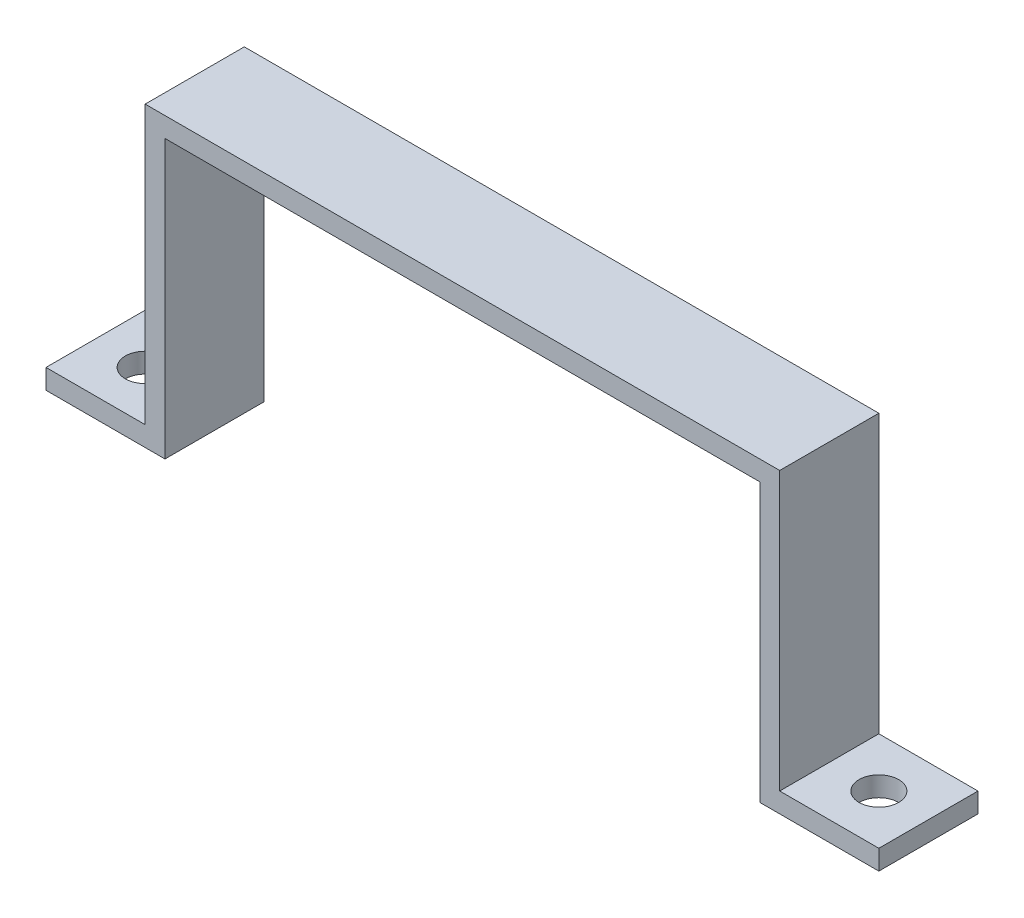
ISO-10303-21;
HEADER;
FILE_DESCRIPTION(('STEP AP214'),'2;1');
FILE_NAME('part.step','',(''),(''),'','','');
FILE_SCHEMA(('AUTOMOTIVE_DESIGN { 1 0 10303 214 1 1 1 1 }'));
ENDSEC;
DATA;
#1=APPLICATION_CONTEXT('core data for automotive mechanical design processes');
#2=APPLICATION_PROTOCOL_DEFINITION('international standard','automotive_design',2000,#1);
#3=PRODUCT_CONTEXT('',#1,'mechanical');
#4=PRODUCT('Part','Part','',(#3));
#5=PRODUCT_RELATED_PRODUCT_CATEGORY('part','',(#4));
#6=PRODUCT_DEFINITION_FORMATION('','',#4);
#7=PRODUCT_DEFINITION_CONTEXT('part definition',#1,'design');
#8=PRODUCT_DEFINITION('design','',#6,#7);
#9=PRODUCT_DEFINITION_SHAPE('','',#8);
#10=(LENGTH_UNIT() NAMED_UNIT(*) SI_UNIT(.MILLI.,.METRE.));
#11=(NAMED_UNIT(*) PLANE_ANGLE_UNIT() SI_UNIT($,.RADIAN.));
#12=(NAMED_UNIT(*) SI_UNIT($,.STERADIAN.) SOLID_ANGLE_UNIT());
#13=UNCERTAINTY_MEASURE_WITH_UNIT(LENGTH_MEASURE(1.E-05),#10,'distance_accuracy_value','');
#14=(GEOMETRIC_REPRESENTATION_CONTEXT(3) GLOBAL_UNCERTAINTY_ASSIGNED_CONTEXT((#13)) GLOBAL_UNIT_ASSIGNED_CONTEXT((#10,
#11,#12)) REPRESENTATION_CONTEXT('',''));
#15=CARTESIAN_POINT('',(0.,0.,0.));
#16=DIRECTION('',(0.,0.,1.));
#17=DIRECTION('',(1.,0.,0.));
#18=AXIS2_PLACEMENT_3D('',#15,#16,#17);
#19=CARTESIAN_POINT('',(-37.4285121000212,-21.3533376917352,10.));
#20=DIRECTION('',(0.,1.,0.));
#21=DIRECTION('',(0.,0.,1.));
#22=AXIS2_PLACEMENT_3D('',#19,#20,#21);
#23=PLANE('',#22);
#24=CARTESIAN_POINT('',(-42.4285121000212,-21.3533376917352,5.));
#25=DIRECTION('',(0.,1.,0.));
#26=DIRECTION('',(0.,0.,1.));
#27=AXIS2_PLACEMENT_3D('',#24,#25,#26);
#28=CIRCLE('',#27,2.);
#29=CARTESIAN_POINT('',(-42.4285121000212,-21.3533376917352,7.));
#30=VERTEX_POINT('',#29);
#31=EDGE_CURVE('E193',#30,#30,#28,.T.);
#32=ORIENTED_EDGE('',*,*,#31,.T.);
#33=EDGE_LOOP('',(#32));
#34=FACE_BOUND('',#33,.T.);
#35=DIRECTION('',(1.,0.,0.));
#36=VECTOR('',#35,1.);
#37=CARTESIAN_POINT('',(-57.4285121000211,-21.3533376917352,10.));
#38=LINE('',#37,#36);
#39=CARTESIAN_POINT('',(-47.4285121000212,-21.3533376917352,10.));
#40=VERTEX_POINT('',#39);
#41=CARTESIAN_POINT('',(-35.4285121000211,-21.3533376917352,10.));
#42=VERTEX_POINT('',#41);
#43=EDGE_CURVE('E153',#40,#42,#38,.T.);
#44=ORIENTED_EDGE('',*,*,#43,.F.);
#45=DIRECTION('',(0.,0.,-1.));
#46=VECTOR('',#45,1.);
#47=CARTESIAN_POINT('',(-47.4285121000212,-21.3533376917352,10.));
#48=LINE('',#47,#46);
#49=CARTESIAN_POINT('',(-47.4285121000212,-21.3533376917352,0.));
#50=VERTEX_POINT('',#49);
#51=EDGE_CURVE('E179',#40,#50,#48,.T.);
#52=ORIENTED_EDGE('',*,*,#51,.T.);
#53=DIRECTION('',(1.,0.,0.));
#54=VECTOR('',#53,1.);
#55=CARTESIAN_POINT('',(-37.4285121000212,-21.3533376917352,0.));
#56=LINE('',#55,#54);
#57=CARTESIAN_POINT('',(-35.4285121000211,-21.3533376917352,0.));
#58=VERTEX_POINT('',#57);
#59=EDGE_CURVE('E186',#50,#58,#56,.T.);
#60=ORIENTED_EDGE('',*,*,#59,.T.);
#61=DIRECTION('',(0.,0.,-1.));
#62=VECTOR('',#61,1.);
#63=CARTESIAN_POINT('',(-35.4285121000211,-21.3533376917352,10.));
#64=LINE('',#63,#62);
#65=EDGE_CURVE('E175',#42,#58,#64,.T.);
#66=ORIENTED_EDGE('',*,*,#65,.F.);
#67=EDGE_LOOP('',(#44,#52,#60,#66));
#68=FACE_BOUND('',#67,.T.);
#69=ADVANCED_FACE('F35',(#34,#68),#23,.F.);
#70=CARTESIAN_POINT('',(-35.4285121000211,-21.3533376917352,10.));
#71=DIRECTION('',(-1.,0.,0.));
#72=DIRECTION('',(0.,0.,1.));
#73=AXIS2_PLACEMENT_3D('',#70,#71,#72);
#74=PLANE('',#73);
#75=DIRECTION('',(0.,1.,0.));
#76=VECTOR('',#75,1.);
#77=CARTESIAN_POINT('',(-35.4285121000211,-21.3533376917352,0.));
#78=LINE('',#77,#76);
#79=CARTESIAN_POINT('',(-35.4285121000211,6.64666230826481,0.));
#80=VERTEX_POINT('',#79);
#81=EDGE_CURVE('E192',#58,#80,#78,.T.);
#82=ORIENTED_EDGE('',*,*,#81,.T.);
#83=DIRECTION('',(0.,0.,-1.));
#84=VECTOR('',#83,1.);
#85=CARTESIAN_POINT('',(-35.4285121000211,6.64666230826481,10.));
#86=LINE('',#85,#84);
#87=CARTESIAN_POINT('',(-35.4285121000211,6.64666230826481,10.));
#88=VERTEX_POINT('',#87);
#89=EDGE_CURVE('E172',#88,#80,#86,.T.);
#90=ORIENTED_EDGE('',*,*,#89,.F.);
#91=DIRECTION('',(0.,1.,0.));
#92=VECTOR('',#91,1.);
#93=CARTESIAN_POINT('',(-35.4285121000211,-21.3533376917352,10.));
#94=LINE('',#93,#92);
#95=EDGE_CURVE('E247',#42,#88,#94,.T.);
#96=ORIENTED_EDGE('',*,*,#95,.F.);
#97=ORIENTED_EDGE('',*,*,#65,.T.);
#98=EDGE_LOOP('',(#82,#90,#96,#97));
#99=FACE_BOUND('',#98,.T.);
#100=ADVANCED_FACE('F254',(#99),#74,.F.);
#101=CARTESIAN_POINT('',(-35.4285121000211,6.64666230826481,10.));
#102=DIRECTION('',(0.,1.,0.));
#103=DIRECTION('',(0.,0.,1.));
#104=AXIS2_PLACEMENT_3D('',#101,#102,#103);
#105=PLANE('',#104);
#106=DIRECTION('',(1.,0.,0.));
#107=VECTOR('',#106,1.);
#108=CARTESIAN_POINT('',(-35.4285121000211,6.64666230826481,0.));
#109=LINE('',#108,#107);
#110=CARTESIAN_POINT('',(24.5714878999788,6.64666230826481,0.));
#111=VERTEX_POINT('',#110);
#112=EDGE_CURVE('E195',#80,#111,#109,.T.);
#113=ORIENTED_EDGE('',*,*,#112,.T.);
#114=DIRECTION('',(0.,0.,-1.));
#115=VECTOR('',#114,1.);
#116=CARTESIAN_POINT('',(24.5714878999788,6.64666230826481,10.));
#117=LINE('',#116,#115);
#118=CARTESIAN_POINT('',(24.5714878999788,6.64666230826481,10.));
#119=VERTEX_POINT('',#118);
#120=EDGE_CURVE('E169',#119,#111,#117,.T.);
#121=ORIENTED_EDGE('',*,*,#120,.F.);
#122=DIRECTION('',(1.,0.,0.));
#123=VECTOR('',#122,1.);
#124=CARTESIAN_POINT('',(-35.4285121000211,6.64666230826481,10.));
#125=LINE('',#124,#123);
#126=EDGE_CURVE('E220',#88,#119,#125,.T.);
#127=ORIENTED_EDGE('',*,*,#126,.F.);
#128=ORIENTED_EDGE('',*,*,#89,.T.);
#129=EDGE_LOOP('',(#113,#121,#127,#128));
#130=FACE_BOUND('',#129,.T.);
#131=ADVANCED_FACE('F252',(#130),#105,.F.);
#132=CARTESIAN_POINT('',(24.5714878999788,6.64666230826481,10.));
#133=DIRECTION('',(1.,0.,0.));
#134=DIRECTION('',(0.,1.,0.));
#135=AXIS2_PLACEMENT_3D('',#132,#133,#134);
#136=PLANE('',#135);
#137=DIRECTION('',(0.,-1.,0.));
#138=VECTOR('',#137,1.);
#139=CARTESIAN_POINT('',(24.5714878999788,6.64666230826481,0.));
#140=LINE('',#139,#138);
#141=CARTESIAN_POINT('',(24.5714878999789,-21.3533376917352,0.));
#142=VERTEX_POINT('',#141);
#143=EDGE_CURVE('E143',#111,#142,#140,.T.);
#144=ORIENTED_EDGE('',*,*,#143,.T.);
#145=DIRECTION('',(0.,0.,-1.));
#146=VECTOR('',#145,1.);
#147=CARTESIAN_POINT('',(24.5714878999789,-21.3533376917352,10.));
#148=LINE('',#147,#146);
#149=CARTESIAN_POINT('',(24.5714878999789,-21.3533376917352,10.));
#150=VERTEX_POINT('',#149);
#151=EDGE_CURVE('E166',#150,#142,#148,.T.);
#152=ORIENTED_EDGE('',*,*,#151,.F.);
#153=DIRECTION('',(0.,-1.,0.));
#154=VECTOR('',#153,1.);
#155=CARTESIAN_POINT('',(24.5714878999788,6.64666230826481,10.));
#156=LINE('',#155,#154);
#157=EDGE_CURVE('E216',#119,#150,#156,.T.);
#158=ORIENTED_EDGE('',*,*,#157,.F.);
#159=ORIENTED_EDGE('',*,*,#120,.T.);
#160=EDGE_LOOP('',(#144,#152,#158,#159));
#161=FACE_BOUND('',#160,.T.);
#162=ADVANCED_FACE('F207',(#161),#136,.F.);
#163=CARTESIAN_POINT('',(26.5714878999789,-21.3533376917352,10.));
#164=DIRECTION('',(0.,1.,0.));
#165=DIRECTION('',(0.,0.,1.));
#166=AXIS2_PLACEMENT_3D('',#163,#164,#165);
#167=PLANE('',#166);
#168=CARTESIAN_POINT('',(31.5714878999789,-21.3533376917352,5.));
#169=DIRECTION('',(0.,1.,0.));
#170=DIRECTION('',(0.,0.,1.));
#171=AXIS2_PLACEMENT_3D('',#168,#169,#170);
#172=CIRCLE('',#171,2.);
#173=CARTESIAN_POINT('',(31.5714878999789,-21.3533376917352,7.));
#174=VERTEX_POINT('',#173);
#175=EDGE_CURVE('E241',#174,#174,#172,.T.);
#176=ORIENTED_EDGE('',*,*,#175,.T.);
#177=EDGE_LOOP('',(#176));
#178=FACE_BOUND('',#177,.T.);
#179=DIRECTION('',(1.,0.,0.));
#180=VECTOR('',#179,1.);
#181=CARTESIAN_POINT('',(26.5714878999789,-21.3533376917352,0.));
#182=LINE('',#181,#180);
#183=CARTESIAN_POINT('',(36.5714878999789,-21.3533376917352,0.));
#184=VERTEX_POINT('',#183);
#185=EDGE_CURVE('E139',#142,#184,#182,.T.);
#186=ORIENTED_EDGE('',*,*,#185,.T.);
#187=DIRECTION('',(0.,0.,1.));
#188=VECTOR('',#187,1.);
#189=CARTESIAN_POINT('',(36.5714878999789,-21.3533376917352,10.));
#190=LINE('',#189,#188);
#191=CARTESIAN_POINT('',(36.5714878999789,-21.3533376917352,10.));
#192=VERTEX_POINT('',#191);
#193=EDGE_CURVE('E48',#184,#192,#190,.T.);
#194=ORIENTED_EDGE('',*,*,#193,.T.);
#195=DIRECTION('',(1.,0.,0.));
#196=VECTOR('',#195,1.);
#197=CARTESIAN_POINT('',(24.5714878999789,-21.3533376917352,10.));
#198=LINE('',#197,#196);
#199=EDGE_CURVE('E214',#150,#192,#198,.T.);
#200=ORIENTED_EDGE('',*,*,#199,.F.);
#201=ORIENTED_EDGE('',*,*,#151,.T.);
#202=EDGE_LOOP('',(#186,#194,#200,#201));
#203=FACE_BOUND('',#202,.T.);
#204=ADVANCED_FACE('F212',(#178,#203),#167,.F.);
#205=CARTESIAN_POINT('',(26.5714878999789,-19.3533376917352,10.));
#206=DIRECTION('',(0.,-1.,0.));
#207=DIRECTION('',(0.,0.,-1.));
#208=AXIS2_PLACEMENT_3D('',#205,#206,#207);
#209=PLANE('',#208);
#210=CARTESIAN_POINT('',(31.5714878999789,-19.3533376917352,5.));
#211=DIRECTION('',(0.,1.,0.));
#212=DIRECTION('',(0.,0.,1.));
#213=AXIS2_PLACEMENT_3D('',#210,#211,#212);
#214=CIRCLE('',#213,2.);
#215=CARTESIAN_POINT('',(31.5714878999789,-19.3533376917352,7.));
#216=VERTEX_POINT('',#215);
#217=EDGE_CURVE('E187',#216,#216,#214,.T.);
#218=ORIENTED_EDGE('',*,*,#217,.F.);
#219=EDGE_LOOP('',(#218));
#220=FACE_BOUND('',#219,.T.);
#221=DIRECTION('',(-1.,0.,0.));
#222=VECTOR('',#221,1.);
#223=CARTESIAN_POINT('',(26.5714878999789,-19.3533376917352,10.));
#224=LINE('',#223,#222);
#225=CARTESIAN_POINT('',(36.5714878999789,-19.3533376917352,10.));
#226=VERTEX_POINT('',#225);
#227=CARTESIAN_POINT('',(26.5714878999789,-19.3533376917352,10.));
#228=VERTEX_POINT('',#227);
#229=EDGE_CURVE('E132',#226,#228,#224,.T.);
#230=ORIENTED_EDGE('',*,*,#229,.F.);
#231=DIRECTION('',(0.,0.,1.));
#232=VECTOR('',#231,1.);
#233=CARTESIAN_POINT('',(36.5714878999789,-19.3533376917352,0.));
#234=LINE('',#233,#232);
#235=CARTESIAN_POINT('',(36.5714878999789,-19.3533376917352,0.));
#236=VERTEX_POINT('',#235);
#237=EDGE_CURVE('E121',#236,#226,#234,.T.);
#238=ORIENTED_EDGE('',*,*,#237,.F.);
#239=DIRECTION('',(-1.,0.,0.));
#240=VECTOR('',#239,1.);
#241=CARTESIAN_POINT('',(26.5714878999789,-19.3533376917352,0.));
#242=LINE('',#241,#240);
#243=CARTESIAN_POINT('',(26.5714878999789,-19.3533376917352,0.));
#244=VERTEX_POINT('',#243);
#245=EDGE_CURVE('E130',#236,#244,#242,.T.);
#246=ORIENTED_EDGE('',*,*,#245,.T.);
#247=DIRECTION('',(0.,0.,-1.));
#248=VECTOR('',#247,1.);
#249=CARTESIAN_POINT('',(26.5714878999789,-19.3533376917352,10.));
#250=LINE('',#249,#248);
#251=EDGE_CURVE('E164',#228,#244,#250,.T.);
#252=ORIENTED_EDGE('',*,*,#251,.F.);
#253=EDGE_LOOP('',(#230,#238,#246,#252));
#254=FACE_BOUND('',#253,.T.);
#255=ADVANCED_FACE('F128',(#220,#254),#209,.F.);
#256=CARTESIAN_POINT('',(26.5714878999789,8.64666230826482,10.));
#257=DIRECTION('',(-1.,0.,0.));
#258=DIRECTION('',(0.,-1.,0.));
#259=AXIS2_PLACEMENT_3D('',#256,#257,#258);
#260=PLANE('',#259);
#261=DIRECTION('',(0.,1.,0.));
#262=VECTOR('',#261,1.);
#263=CARTESIAN_POINT('',(26.5714878999789,8.64666230826482,0.));
#264=LINE('',#263,#262);
#265=CARTESIAN_POINT('',(26.5714878999789,8.64666230826482,0.));
#266=VERTEX_POINT('',#265);
#267=EDGE_CURVE('E138',#244,#266,#264,.T.);
#268=ORIENTED_EDGE('',*,*,#267,.T.);
#269=DIRECTION('',(0.,0.,-1.));
#270=VECTOR('',#269,1.);
#271=CARTESIAN_POINT('',(26.5714878999789,8.64666230826482,10.));
#272=LINE('',#271,#270);
#273=CARTESIAN_POINT('',(26.5714878999789,8.64666230826482,10.));
#274=VERTEX_POINT('',#273);
#275=EDGE_CURVE('E161',#274,#266,#272,.T.);
#276=ORIENTED_EDGE('',*,*,#275,.F.);
#277=DIRECTION('',(0.,1.,0.));
#278=VECTOR('',#277,1.);
#279=CARTESIAN_POINT('',(26.5714878999789,8.64666230826482,10.));
#280=LINE('',#279,#278);
#281=EDGE_CURVE('E218',#228,#274,#280,.T.);
#282=ORIENTED_EDGE('',*,*,#281,.F.);
#283=ORIENTED_EDGE('',*,*,#251,.T.);
#284=EDGE_LOOP('',(#268,#276,#282,#283));
#285=FACE_BOUND('',#284,.T.);
#286=ADVANCED_FACE('F270',(#285),#260,.F.);
#287=CARTESIAN_POINT('',(-37.4285121000212,8.64666230826482,10.));
#288=DIRECTION('',(0.,-1.,0.));
#289=DIRECTION('',(0.,0.,-1.));
#290=AXIS2_PLACEMENT_3D('',#287,#288,#289);
#291=PLANE('',#290);
#292=DIRECTION('',(-1.,0.,0.));
#293=VECTOR('',#292,1.);
#294=CARTESIAN_POINT('',(-37.4285121000212,8.64666230826482,0.));
#295=LINE('',#294,#293);
#296=CARTESIAN_POINT('',(-37.4285121000212,8.64666230826482,0.));
#297=VERTEX_POINT('',#296);
#298=EDGE_CURVE('E141',#266,#297,#295,.T.);
#299=ORIENTED_EDGE('',*,*,#298,.T.);
#300=DIRECTION('',(0.,0.,-1.));
#301=VECTOR('',#300,1.);
#302=CARTESIAN_POINT('',(-37.4285121000212,8.64666230826482,10.));
#303=LINE('',#302,#301);
#304=CARTESIAN_POINT('',(-37.4285121000212,8.64666230826482,10.));
#305=VERTEX_POINT('',#304);
#306=EDGE_CURVE('E157',#305,#297,#303,.T.);
#307=ORIENTED_EDGE('',*,*,#306,.F.);
#308=DIRECTION('',(-1.,0.,0.));
#309=VECTOR('',#308,1.);
#310=CARTESIAN_POINT('',(24.5714878999788,8.64666230826482,10.));
#311=LINE('',#310,#309);
#312=EDGE_CURVE('E225',#274,#305,#311,.T.);
#313=ORIENTED_EDGE('',*,*,#312,.F.);
#314=ORIENTED_EDGE('',*,*,#275,.T.);
#315=EDGE_LOOP('',(#299,#307,#313,#314));
#316=FACE_BOUND('',#315,.T.);
#317=ADVANCED_FACE('F274',(#316),#291,.F.);
#318=CARTESIAN_POINT('',(-37.4285121000212,-19.3533376917352,10.));
#319=DIRECTION('',(1.,0.,0.));
#320=DIRECTION('',(0.,0.,-1.));
#321=AXIS2_PLACEMENT_3D('',#318,#319,#320);
#322=PLANE('',#321);
#323=DIRECTION('',(0.,-1.,0.));
#324=VECTOR('',#323,1.);
#325=CARTESIAN_POINT('',(-37.4285121000212,-19.3533376917352,0.));
#326=LINE('',#325,#324);
#327=CARTESIAN_POINT('',(-37.4285121000212,-19.3533376917352,0.));
#328=VERTEX_POINT('',#327);
#329=EDGE_CURVE('E148',#297,#328,#326,.T.);
#330=ORIENTED_EDGE('',*,*,#329,.T.);
#331=DIRECTION('',(0.,0.,-1.));
#332=VECTOR('',#331,1.);
#333=CARTESIAN_POINT('',(-37.4285121000212,-19.3533376917352,10.));
#334=LINE('',#333,#332);
#335=CARTESIAN_POINT('',(-37.4285121000212,-19.3533376917352,10.));
#336=VERTEX_POINT('',#335);
#337=EDGE_CURVE('E154',#336,#328,#334,.T.);
#338=ORIENTED_EDGE('',*,*,#337,.F.);
#339=DIRECTION('',(0.,-1.,0.));
#340=VECTOR('',#339,1.);
#341=CARTESIAN_POINT('',(-37.4285121000212,-19.3533376917352,10.));
#342=LINE('',#341,#340);
#343=EDGE_CURVE('E226',#305,#336,#342,.T.);
#344=ORIENTED_EDGE('',*,*,#343,.F.);
#345=ORIENTED_EDGE('',*,*,#306,.T.);
#346=EDGE_LOOP('',(#330,#338,#344,#345));
#347=FACE_BOUND('',#346,.T.);
#348=ADVANCED_FACE('F278',(#347),#322,.F.);
#349=CARTESIAN_POINT('',(-57.4285121000211,-19.3533376917352,10.));
#350=DIRECTION('',(0.,-1.,0.));
#351=DIRECTION('',(0.,0.,-1.));
#352=AXIS2_PLACEMENT_3D('',#349,#350,#351);
#353=PLANE('',#352);
#354=CARTESIAN_POINT('',(-42.4285121000212,-19.3533376917352,5.));
#355=DIRECTION('',(0.,1.,0.));
#356=DIRECTION('',(0.,0.,1.));
#357=AXIS2_PLACEMENT_3D('',#354,#355,#356);
#358=CIRCLE('',#357,2.);
#359=CARTESIAN_POINT('',(-42.4285121000212,-19.3533376917352,7.));
#360=VERTEX_POINT('',#359);
#361=EDGE_CURVE('E198',#360,#360,#358,.T.);
#362=ORIENTED_EDGE('',*,*,#361,.F.);
#363=EDGE_LOOP('',(#362));
#364=FACE_BOUND('',#363,.T.);
#365=DIRECTION('',(-1.,0.,0.));
#366=VECTOR('',#365,1.);
#367=CARTESIAN_POINT('',(-57.4285121000211,-19.3533376917352,0.));
#368=LINE('',#367,#366);
#369=CARTESIAN_POINT('',(-47.4285121000212,-19.3533376917352,0.));
#370=VERTEX_POINT('',#369);
#371=EDGE_CURVE('E150',#328,#370,#368,.T.);
#372=ORIENTED_EDGE('',*,*,#371,.T.);
#373=DIRECTION('',(0.,0.,-1.));
#374=VECTOR('',#373,1.);
#375=CARTESIAN_POINT('',(-47.4285121000212,-19.3533376917352,0.));
#376=LINE('',#375,#374);
#377=CARTESIAN_POINT('',(-47.4285121000212,-19.3533376917352,10.));
#378=VERTEX_POINT('',#377);
#379=EDGE_CURVE('E56',#378,#370,#376,.T.);
#380=ORIENTED_EDGE('',*,*,#379,.F.);
#381=DIRECTION('',(-1.,0.,0.));
#382=VECTOR('',#381,1.);
#383=CARTESIAN_POINT('',(-57.4285121000211,-19.3533376917352,10.));
#384=LINE('',#383,#382);
#385=EDGE_CURVE('E158',#336,#378,#384,.T.);
#386=ORIENTED_EDGE('',*,*,#385,.F.);
#387=ORIENTED_EDGE('',*,*,#337,.T.);
#388=EDGE_LOOP('',(#372,#380,#386,#387));
#389=FACE_BOUND('',#388,.T.);
#390=ADVANCED_FACE('F233',(#364,#389),#353,.F.);
#391=CARTESIAN_POINT('',(0.,0.,10.));
#392=DIRECTION('',(0.,0.,-1.));
#393=DIRECTION('',(-1.,0.,0.));
#394=AXIS2_PLACEMENT_3D('',#391,#392,#393);
#395=PLANE('',#394);
#396=ORIENTED_EDGE('',*,*,#199,.T.);
#397=DIRECTION('',(0.,1.,0.));
#398=VECTOR('',#397,1.);
#399=CARTESIAN_POINT('',(36.5714878999789,-29.3533376917352,10.));
#400=LINE('',#399,#398);
#401=EDGE_CURVE('E133',#192,#226,#400,.T.);
#402=ORIENTED_EDGE('',*,*,#401,.T.);
#403=ORIENTED_EDGE('',*,*,#229,.T.);
#404=ORIENTED_EDGE('',*,*,#281,.T.);
#405=ORIENTED_EDGE('',*,*,#312,.T.);
#406=ORIENTED_EDGE('',*,*,#343,.T.);
#407=ORIENTED_EDGE('',*,*,#385,.T.);
#408=DIRECTION('',(0.,1.,0.));
#409=VECTOR('',#408,1.);
#410=CARTESIAN_POINT('',(-47.4285121000212,-29.3533376917352,10.));
#411=LINE('',#410,#409);
#412=EDGE_CURVE('E188',#40,#378,#411,.T.);
#413=ORIENTED_EDGE('',*,*,#412,.F.);
#414=ORIENTED_EDGE('',*,*,#43,.T.);
#415=ORIENTED_EDGE('',*,*,#95,.T.);
#416=ORIENTED_EDGE('',*,*,#126,.T.);
#417=ORIENTED_EDGE('',*,*,#157,.T.);
#418=EDGE_LOOP('',(#396,#402,#403,#404,#405,#406,#407,#413,#414,#415,#416,#417));
#419=FACE_BOUND('',#418,.T.);
#420=ADVANCED_FACE('F231',(#419),#395,.F.);
#421=CARTESIAN_POINT('',(0.,0.,0.));
#422=DIRECTION('',(0.,0.,-1.));
#423=DIRECTION('',(-1.,0.,0.));
#424=AXIS2_PLACEMENT_3D('',#421,#422,#423);
#425=PLANE('',#424);
#426=DIRECTION('',(0.,1.,0.));
#427=VECTOR('',#426,1.);
#428=CARTESIAN_POINT('',(36.5714878999789,0.,0.));
#429=LINE('',#428,#427);
#430=EDGE_CURVE('E11',#184,#236,#429,.T.);
#431=ORIENTED_EDGE('',*,*,#430,.F.);
#432=ORIENTED_EDGE('',*,*,#185,.F.);
#433=ORIENTED_EDGE('',*,*,#143,.F.);
#434=ORIENTED_EDGE('',*,*,#112,.F.);
#435=ORIENTED_EDGE('',*,*,#81,.F.);
#436=ORIENTED_EDGE('',*,*,#59,.F.);
#437=DIRECTION('',(0.,-1.,0.));
#438=VECTOR('',#437,1.);
#439=CARTESIAN_POINT('',(-47.4285121000212,0.,0.));
#440=LINE('',#439,#438);
#441=EDGE_CURVE('E42',#370,#50,#440,.T.);
#442=ORIENTED_EDGE('',*,*,#441,.F.);
#443=ORIENTED_EDGE('',*,*,#371,.F.);
#444=ORIENTED_EDGE('',*,*,#329,.F.);
#445=ORIENTED_EDGE('',*,*,#298,.F.);
#446=ORIENTED_EDGE('',*,*,#267,.F.);
#447=ORIENTED_EDGE('',*,*,#245,.F.);
#448=EDGE_LOOP('',(#431,#432,#433,#434,#435,#436,#442,#443,#444,#445,#446,#447));
#449=FACE_BOUND('',#448,.T.);
#450=ADVANCED_FACE('F136',(#449),#425,.T.);
#451=CARTESIAN_POINT('',(-42.4285121000212,-29.3533376917352,5.));
#452=DIRECTION('',(0.,1.,0.));
#453=DIRECTION('',(0.,0.,1.));
#454=AXIS2_PLACEMENT_3D('',#451,#452,#453);
#455=CYLINDRICAL_SURFACE('',#454,2.);
#456=ORIENTED_EDGE('',*,*,#361,.T.);
#457=EDGE_LOOP('',(#456));
#458=FACE_BOUND('',#457,.T.);
#459=ORIENTED_EDGE('',*,*,#31,.F.);
#460=EDGE_LOOP('',(#459));
#461=FACE_BOUND('',#460,.T.);
#462=ADVANCED_FACE('F288',(#458,#461),#455,.F.);
#463=CARTESIAN_POINT('',(31.5714878999789,-29.3533376917352,5.));
#464=DIRECTION('',(0.,1.,0.));
#465=DIRECTION('',(0.,0.,1.));
#466=AXIS2_PLACEMENT_3D('',#463,#464,#465);
#467=CYLINDRICAL_SURFACE('',#466,2.);
#468=ORIENTED_EDGE('',*,*,#217,.T.);
#469=EDGE_LOOP('',(#468));
#470=FACE_BOUND('',#469,.T.);
#471=ORIENTED_EDGE('',*,*,#175,.F.);
#472=EDGE_LOOP('',(#471));
#473=FACE_BOUND('',#472,.T.);
#474=ADVANCED_FACE('F293',(#470,#473),#467,.F.);
#475=CARTESIAN_POINT('',(-47.4285121000212,-29.3533376917352,0.));
#476=DIRECTION('',(1.,0.,0.));
#477=DIRECTION('',(0.,0.,-1.));
#478=AXIS2_PLACEMENT_3D('',#475,#476,#477);
#479=PLANE('',#478);
#480=ORIENTED_EDGE('',*,*,#412,.T.);
#481=ORIENTED_EDGE('',*,*,#379,.T.);
#482=ORIENTED_EDGE('',*,*,#441,.T.);
#483=ORIENTED_EDGE('',*,*,#51,.F.);
#484=EDGE_LOOP('',(#480,#481,#482,#483));
#485=FACE_BOUND('',#484,.T.);
#486=ADVANCED_FACE('F178',(#485),#479,.F.);
#487=CARTESIAN_POINT('',(36.5714878999789,-29.3533376917352,0.));
#488=DIRECTION('',(-1.,0.,0.));
#489=DIRECTION('',(0.,0.,1.));
#490=AXIS2_PLACEMENT_3D('',#487,#488,#489);
#491=PLANE('',#490);
#492=ORIENTED_EDGE('',*,*,#430,.T.);
#493=ORIENTED_EDGE('',*,*,#237,.T.);
#494=ORIENTED_EDGE('',*,*,#401,.F.);
#495=ORIENTED_EDGE('',*,*,#193,.F.);
#496=EDGE_LOOP('',(#492,#493,#494,#495));
#497=FACE_BOUND('',#496,.T.);
#498=ADVANCED_FACE('F120',(#497),#491,.F.);
#499=CLOSED_SHELL('',(#69,#100,#131,#162,#204,#255,#286,#317,#348,#390,#420,#450,#462,#474,#486,#498));
#500=MANIFOLD_SOLID_BREP('B2',#499);
#501=ADVANCED_BREP_SHAPE_REPRESENTATION('',(#18,#500),#14);
#502=SHAPE_DEFINITION_REPRESENTATION(#9,#501);
ENDSEC;
END-ISO-10303-21;
